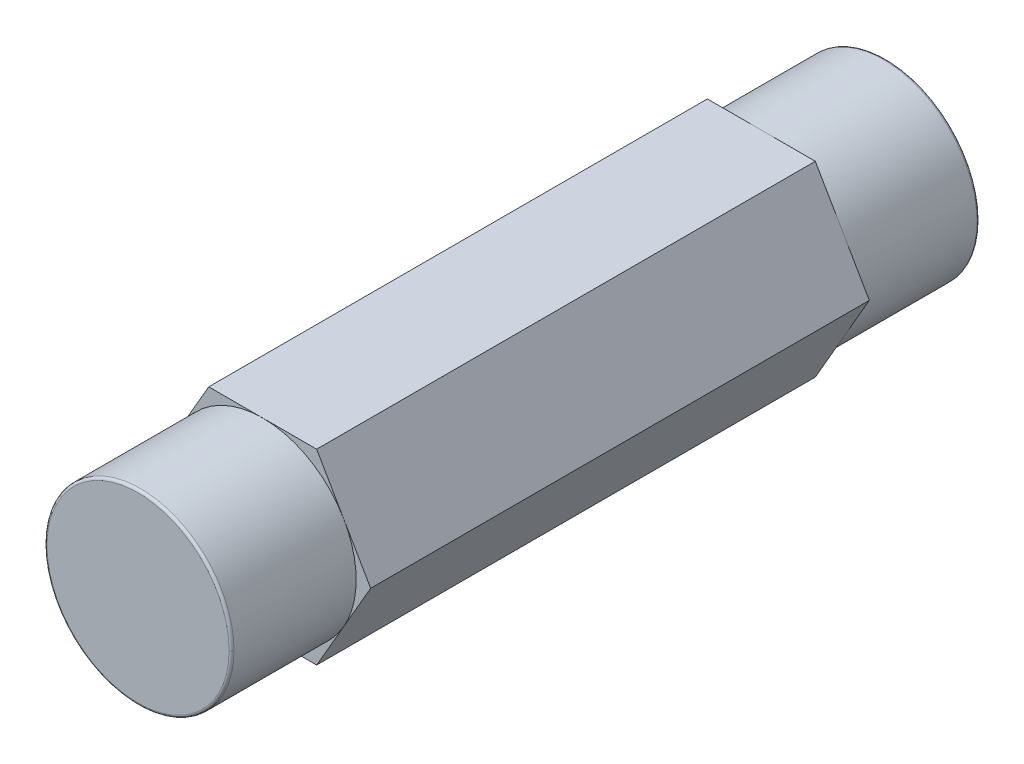
ISO-10303-21;
HEADER;
FILE_DESCRIPTION(('STEP AP214'),'2;1');
FILE_NAME('part.step','',(''),(''),'','','');
FILE_SCHEMA(('AUTOMOTIVE_DESIGN { 1 0 10303 214 1 1 1 1 }'));
ENDSEC;
DATA;
#1=APPLICATION_CONTEXT('core data for automotive mechanical design processes');
#2=APPLICATION_PROTOCOL_DEFINITION('international standard','automotive_design',2000,#1);
#3=PRODUCT_CONTEXT('',#1,'mechanical');
#4=PRODUCT('Part','Part','',(#3));
#5=PRODUCT_RELATED_PRODUCT_CATEGORY('part','',(#4));
#6=PRODUCT_DEFINITION_FORMATION('','',#4);
#7=PRODUCT_DEFINITION_CONTEXT('part definition',#1,'design');
#8=PRODUCT_DEFINITION('design','',#6,#7);
#9=PRODUCT_DEFINITION_SHAPE('','',#8);
#10=(LENGTH_UNIT() NAMED_UNIT(*) SI_UNIT(.MILLI.,.METRE.));
#11=(NAMED_UNIT(*) PLANE_ANGLE_UNIT() SI_UNIT($,.RADIAN.));
#12=(NAMED_UNIT(*) SI_UNIT($,.STERADIAN.) SOLID_ANGLE_UNIT());
#13=UNCERTAINTY_MEASURE_WITH_UNIT(LENGTH_MEASURE(1.E-05),#10,'distance_accuracy_value','');
#14=(GEOMETRIC_REPRESENTATION_CONTEXT(3) GLOBAL_UNCERTAINTY_ASSIGNED_CONTEXT((#13)) GLOBAL_UNIT_ASSIGNED_CONTEXT((#10,
#11,#12)) REPRESENTATION_CONTEXT('',''));
#15=CARTESIAN_POINT('',(0.,0.,0.));
#16=DIRECTION('',(0.,0.,1.));
#17=DIRECTION('',(1.,0.,0.));
#18=AXIS2_PLACEMENT_3D('',#15,#16,#17);
#19=CARTESIAN_POINT('',(0.,0.,0.));
#20=DIRECTION('',(0.,0.,1.));
#21=DIRECTION('',(1.,0.,0.));
#22=AXIS2_PLACEMENT_3D('',#19,#20,#21);
#23=PLANE('',#22);
#24=CARTESIAN_POINT('',(0.,0.,0.));
#25=DIRECTION('',(0.,0.,1.));
#26=DIRECTION('',(1.,0.,0.));
#27=AXIS2_PLACEMENT_3D('',#24,#25,#26);
#28=CIRCLE('',#27,4.6355);
#29=CARTESIAN_POINT('',(-4.6355,0.,0.));
#30=VERTEX_POINT('',#29);
#31=CARTESIAN_POINT('',(4.6355,0.,0.));
#32=VERTEX_POINT('',#31);
#33=EDGE_CURVE('E177',#30,#32,#28,.F.);
#34=ORIENTED_EDGE('',*,*,#33,.T.);
#35=CARTESIAN_POINT('',(0.,0.,0.));
#36=DIRECTION('',(0.,0.,1.));
#37=DIRECTION('',(-1.,0.,0.));
#38=AXIS2_PLACEMENT_3D('',#35,#36,#37);
#39=CIRCLE('',#38,4.6355);
#40=EDGE_CURVE('E233',#32,#30,#39,.F.);
#41=ORIENTED_EDGE('',*,*,#40,.T.);
#42=EDGE_LOOP('',(#34,#41));
#43=FACE_BOUND('',#42,.T.);
#44=ADVANCED_FACE('F17',(#43),#23,.F.);
#45=CARTESIAN_POINT('',(4.6355,0.,0.));
#46=CARTESIAN_POINT('',(4.70989487757862,0.,0.));
#47=CARTESIAN_POINT('',(4.7625,0.,0.0526051224213831));
#48=CARTESIAN_POINT('',(4.7625,0.,0.127));
#49=(BOUNDED_CURVE() B_SPLINE_CURVE(3,(#45,#46,#47,#48),.UNSPECIFIED.,.F.,
.F.) B_SPLINE_CURVE_WITH_KNOTS((4,4),(0.,1.),
.UNSPECIFIED.) CURVE() GEOMETRIC_REPRESENTATION_ITEM() RATIONAL_B_SPLINE_CURVE((1.,
0.804737854124365,0.804737854124365,1.)) REPRESENTATION_ITEM(''));
#50=CARTESIAN_POINT('',(0.,0.,0.127));
#51=DIRECTION('',(0.,0.,1.));
#52=AXIS1_PLACEMENT('',#50,#51);
#53=SURFACE_OF_REVOLUTION('',#49,#52);
#54=CARTESIAN_POINT('',(0.,0.,0.1270000007112));
#55=DIRECTION('',(0.,0.,-1.));
#56=DIRECTION('',(-1.,0.,0.));
#57=AXIS2_PLACEMENT_3D('',#54,#55,#56);
#58=CIRCLE('',#57,4.7625);
#59=CARTESIAN_POINT('',(-4.7625,0.,0.1270000007112));
#60=VERTEX_POINT('',#59);
#61=EDGE_CURVE('E155',#60,#60,#58,.T.);
#62=ORIENTED_EDGE('',*,*,#61,.T.);
#63=EDGE_LOOP('',(#62));
#64=FACE_BOUND('',#63,.T.);
#65=ORIENTED_EDGE('',*,*,#33,.F.);
#66=ORIENTED_EDGE('',*,*,#40,.F.);
#67=EDGE_LOOP('',(#65,#66));
#68=FACE_BOUND('',#67,.T.);
#69=ADVANCED_FACE('F187',(#64,#68),#53,.T.);
#70=CARTESIAN_POINT('',(0.,0.,6.35));
#71=DIRECTION('',(0.,0.,-1.));
#72=DIRECTION('',(-1.,0.,0.));
#73=AXIS2_PLACEMENT_3D('',#70,#71,#72);
#74=CYLINDRICAL_SURFACE('',#73,4.7625);
#75=ORIENTED_EDGE('',*,*,#61,.F.);
#76=EDGE_LOOP('',(#75));
#77=FACE_BOUND('',#76,.T.);
#78=CARTESIAN_POINT('',(0.,0.,6.35));
#79=DIRECTION('',(0.,0.,-1.));
#80=DIRECTION('',(-1.,0.,0.));
#81=AXIS2_PLACEMENT_3D('',#78,#79,#80);
#82=CIRCLE('',#81,4.7625);
#83=CARTESIAN_POINT('',(7.93759182454384E-11,4.76250000008065,6.35));
#84=VERTEX_POINT('',#83);
#85=CARTESIAN_POINT('',(4.12444598546886,2.38124999996313,6.35));
#86=VERTEX_POINT('',#85);
#87=EDGE_CURVE('E123',#84,#86,#82,.T.);
#88=ORIENTED_EDGE('',*,*,#87,.T.);
#89=CARTESIAN_POINT('',(0.,0.,6.35));
#90=DIRECTION('',(0.,0.,-1.));
#91=DIRECTION('',(-1.,0.,0.));
#92=AXIS2_PLACEMENT_3D('',#89,#90,#91);
#93=CIRCLE('',#92,4.7625);
#94=CARTESIAN_POINT('',(4.12444598526673,-2.38125000037889,6.35));
#95=VERTEX_POINT('',#94);
#96=EDGE_CURVE('E129',#86,#95,#93,.T.);
#97=ORIENTED_EDGE('',*,*,#96,.T.);
#98=CARTESIAN_POINT('',(0.,0.,6.35));
#99=DIRECTION('',(0.,0.,-1.));
#100=DIRECTION('',(-1.,0.,0.));
#101=AXIS2_PLACEMENT_3D('',#98,#99,#100);
#102=CIRCLE('',#101,4.7625);
#103=CARTESIAN_POINT('',(-6.10882556761237E-10,-4.76250000008065,6.35));
#104=VERTEX_POINT('',#103);
#105=EDGE_CURVE('E137',#95,#104,#102,.T.);
#106=ORIENTED_EDGE('',*,*,#105,.T.);
#107=CARTESIAN_POINT('',(0.,0.,6.35));
#108=DIRECTION('',(0.,0.,-1.));
#109=DIRECTION('',(-1.,0.,0.));
#110=AXIS2_PLACEMENT_3D('',#107,#108,#109);
#111=CIRCLE('',#110,4.7625);
#112=CARTESIAN_POINT('',(-4.12444598566227,-2.38124999969379,6.35));
#113=VERTEX_POINT('',#112);
#114=EDGE_CURVE('E228',#104,#113,#111,.T.);
#115=ORIENTED_EDGE('',*,*,#114,.T.);
#116=CARTESIAN_POINT('',(0.,0.,6.35));
#117=DIRECTION('',(0.,0.,-1.));
#118=DIRECTION('',(-1.,0.,0.));
#119=AXIS2_PLACEMENT_3D('',#116,#117,#118);
#120=CIRCLE('',#119,4.7625);
#121=CARTESIAN_POINT('',(-4.12444598549729,2.38124999997954,6.35));
#122=VERTEX_POINT('',#121);
#123=EDGE_CURVE('E172',#113,#122,#120,.T.);
#124=ORIENTED_EDGE('',*,*,#123,.T.);
#125=CARTESIAN_POINT('',(0.,0.,6.35));
#126=DIRECTION('',(0.,0.,-1.));
#127=DIRECTION('',(-1.,0.,0.));
#128=AXIS2_PLACEMENT_3D('',#125,#126,#127);
#129=CIRCLE('',#128,4.7625);
#130=EDGE_CURVE('E153',#122,#84,#129,.T.);
#131=ORIENTED_EDGE('',*,*,#130,.T.);
#132=EDGE_LOOP('',(#88,#97,#106,#115,#124,#131));
#133=FACE_BOUND('',#132,.T.);
#134=ADVANCED_FACE('F151',(#77,#133),#74,.T.);
#135=CARTESIAN_POINT('',(0.,0.,6.35));
#136=DIRECTION('',(0.,0.,-1.));
#137=DIRECTION('',(-1.,0.,0.));
#138=AXIS2_PLACEMENT_3D('',#135,#136,#137);
#139=PLANE('',#138);
#140=DIRECTION('',(0.499999999976173,-0.866025403798195,0.));
#141=VECTOR('',#140,1.);
#142=CARTESIAN_POINT('',(4.12444598553204,2.3812499998537,6.35));
#143=LINE('',#142,#141);
#144=CARTESIAN_POINT('',(2.74963065736356,4.76249999985952,6.35));
#145=VERTEX_POINT('',#144);
#146=EDGE_CURVE('E143',#145,#86,#143,.T.);
#147=ORIENTED_EDGE('',*,*,#146,.T.);
#148=ORIENTED_EDGE('',*,*,#87,.F.);
#149=DIRECTION('',(1.,0.,0.));
#150=VECTOR('',#149,1.);
#151=CARTESIAN_POINT('',(0.,4.76250000016129,6.35));
#152=LINE('',#151,#150);
#153=EDGE_CURVE('E158',#84,#145,#152,.T.);
#154=ORIENTED_EDGE('',*,*,#153,.T.);
#155=EDGE_LOOP('',(#147,#148,#154));
#156=FACE_BOUND('',#155,.T.);
#157=ADVANCED_FACE('F157',(#156),#139,.T.);
#158=CARTESIAN_POINT('',(0.,0.,6.35));
#159=DIRECTION('',(0.,0.,-1.));
#160=DIRECTION('',(-1.,0.,0.));
#161=AXIS2_PLACEMENT_3D('',#158,#159,#160);
#162=PLANE('',#161);
#163=DIRECTION('',(1.,0.,0.));
#164=VECTOR('',#163,1.);
#165=CARTESIAN_POINT('',(0.,-4.76250000016129,6.35));
#166=LINE('',#165,#164);
#167=CARTESIAN_POINT('',(2.74963065719535,-4.76249999985952,6.35));
#168=VERTEX_POINT('',#167);
#169=EDGE_CURVE('E136',#168,#104,#166,.F.);
#170=ORIENTED_EDGE('',*,*,#169,.T.);
#171=ORIENTED_EDGE('',*,*,#105,.F.);
#172=DIRECTION('',(-0.499999999976173,-0.866025403798195,0.));
#173=VECTOR('',#172,1.);
#174=CARTESIAN_POINT('',(4.12444598553204,-2.3812499998537,6.35));
#175=LINE('',#174,#173);
#176=EDGE_CURVE('E159',#95,#168,#175,.T.);
#177=ORIENTED_EDGE('',*,*,#176,.T.);
#178=EDGE_LOOP('',(#170,#171,#177));
#179=FACE_BOUND('',#178,.T.);
#180=ADVANCED_FACE('F451',(#179),#162,.T.);
#181=CARTESIAN_POINT('',(0.,0.,6.35));
#182=DIRECTION('',(0.,0.,-1.));
#183=DIRECTION('',(-1.,0.,0.));
#184=AXIS2_PLACEMENT_3D('',#181,#182,#183);
#185=PLANE('',#184);
#186=DIRECTION('',(-0.499999999976173,-0.866025403798195,0.));
#187=VECTOR('',#186,1.);
#188=CARTESIAN_POINT('',(4.12444598553204,-2.3812499998537,6.35));
#189=LINE('',#188,#187);
#190=CARTESIAN_POINT('',(5.49926131361601,-1.45494438256547E-10,6.35));
#191=VERTEX_POINT('',#190);
#192=EDGE_CURVE('E134',#191,#95,#189,.T.);
#193=ORIENTED_EDGE('',*,*,#192,.T.);
#194=ORIENTED_EDGE('',*,*,#96,.F.);
#195=DIRECTION('',(0.499999999976173,-0.866025403798195,0.));
#196=VECTOR('',#195,1.);
#197=CARTESIAN_POINT('',(4.12444598553204,2.3812499998537,6.35));
#198=LINE('',#197,#196);
#199=EDGE_CURVE('E132',#86,#191,#198,.T.);
#200=ORIENTED_EDGE('',*,*,#199,.T.);
#201=EDGE_LOOP('',(#193,#194,#200));
#202=FACE_BOUND('',#201,.T.);
#203=ADVANCED_FACE('F131',(#202),#185,.T.);
#204=CARTESIAN_POINT('',(0.,-4.76250000016129,0.));
#205=DIRECTION('',(0.,1.,0.));
#206=DIRECTION('',(0.,0.,1.));
#207=AXIS2_PLACEMENT_3D('',#204,#205,#206);
#208=PLANE('',#207);
#209=DIRECTION('',(0.,0.,1.));
#210=VECTOR('',#209,1.);
#211=CARTESIAN_POINT('',(2.74963065719535,-4.76249999970864,0.));
#212=LINE('',#211,#210);
#213=CARTESIAN_POINT('',(2.74963065753178,-4.76249999990288,31.7499999967742));
#214=VERTEX_POINT('',#213);
#215=EDGE_CURVE('E162',#168,#214,#212,.T.);
#216=ORIENTED_EDGE('',*,*,#215,.T.);
#217=DIRECTION('',(1.,0.,0.));
#218=VECTOR('',#217,1.);
#219=CARTESIAN_POINT('',(0.,-4.7625,31.7499999967742));
#220=LINE('',#219,#218);
#221=CARTESIAN_POINT('',(-4.61120253145E-10,-4.7625,31.7499999983871));
#222=VERTEX_POINT('',#221);
#223=EDGE_CURVE('E395',#214,#222,#220,.F.);
#224=ORIENTED_EDGE('',*,*,#223,.T.);
#225=DIRECTION('',(1.,0.,0.));
#226=VECTOR('',#225,1.);
#227=CARTESIAN_POINT('',(0.,-4.7625,31.7499999967742));
#228=LINE('',#227,#226);
#229=CARTESIAN_POINT('',(-2.74963065736356,-4.76249999980576,31.7499999989247));
#230=VERTEX_POINT('',#229);
#231=EDGE_CURVE('E388',#222,#230,#228,.F.);
#232=ORIENTED_EDGE('',*,*,#231,.T.);
#233=DIRECTION('',(0.,0.,1.));
#234=VECTOR('',#233,1.);
#235=CARTESIAN_POINT('',(-2.74963065719535,-4.76249999970864,0.));
#236=LINE('',#235,#234);
#237=CARTESIAN_POINT('',(-2.74963065736356,-4.76249999980576,6.35));
#238=VERTEX_POINT('',#237);
#239=EDGE_CURVE('E384',#230,#238,#236,.F.);
#240=ORIENTED_EDGE('',*,*,#239,.T.);
#241=DIRECTION('',(-1.,0.,0.));
#242=VECTOR('',#241,1.);
#243=CARTESIAN_POINT('',(0.,-4.7625,6.35));
#244=LINE('',#243,#242);
#245=EDGE_CURVE('E230',#238,#104,#244,.F.);
#246=ORIENTED_EDGE('',*,*,#245,.T.);
#247=ORIENTED_EDGE('',*,*,#169,.F.);
#248=EDGE_LOOP('',(#216,#224,#232,#240,#246,#247));
#249=FACE_BOUND('',#248,.T.);
#250=ADVANCED_FACE('F458',(#249),#208,.F.);
#251=CARTESIAN_POINT('',(0.,0.,6.35));
#252=DIRECTION('',(0.,0.,-1.));
#253=DIRECTION('',(-1.,0.,0.));
#254=AXIS2_PLACEMENT_3D('',#251,#252,#253);
#255=PLANE('',#254);
#256=ORIENTED_EDGE('',*,*,#114,.F.);
#257=ORIENTED_EDGE('',*,*,#245,.F.);
#258=DIRECTION('',(-0.499999999976173,0.866025403798195,0.));
#259=VECTOR('',#258,1.);
#260=CARTESIAN_POINT('',(-4.12444598553204,-2.3812499998537,6.35));
#261=LINE('',#260,#259);
#262=EDGE_CURVE('E413',#238,#113,#261,.T.);
#263=ORIENTED_EDGE('',*,*,#262,.T.);
#264=EDGE_LOOP('',(#256,#257,#263));
#265=FACE_BOUND('',#264,.T.);
#266=ADVANCED_FACE('F456',(#265),#255,.T.);
#267=CARTESIAN_POINT('',(0.,0.,6.35));
#268=DIRECTION('',(0.,0.,-1.));
#269=DIRECTION('',(-1.,0.,0.));
#270=AXIS2_PLACEMENT_3D('',#267,#268,#269);
#271=PLANE('',#270);
#272=ORIENTED_EDGE('',*,*,#130,.F.);
#273=DIRECTION('',(0.499999999976173,0.866025403798195,0.));
#274=VECTOR('',#273,1.);
#275=CARTESIAN_POINT('',(-4.12444598553204,2.3812499998537,6.35));
#276=LINE('',#275,#274);
#277=CARTESIAN_POINT('',(-2.74963065719535,4.76249999985952,6.35));
#278=VERTEX_POINT('',#277);
#279=EDGE_CURVE('E408',#122,#278,#276,.T.);
#280=ORIENTED_EDGE('',*,*,#279,.T.);
#281=DIRECTION('',(1.,0.,0.));
#282=VECTOR('',#281,1.);
#283=CARTESIAN_POINT('',(0.,4.76250000016129,6.35));
#284=LINE('',#283,#282);
#285=EDGE_CURVE('E148',#278,#84,#284,.T.);
#286=ORIENTED_EDGE('',*,*,#285,.T.);
#287=EDGE_LOOP('',(#272,#280,#286));
#288=FACE_BOUND('',#287,.T.);
#289=ADVANCED_FACE('F480',(#288),#271,.T.);
#290=CARTESIAN_POINT('',(0.,0.,6.35));
#291=DIRECTION('',(0.,0.,-1.));
#292=DIRECTION('',(-1.,0.,0.));
#293=AXIS2_PLACEMENT_3D('',#290,#291,#292);
#294=PLANE('',#293);
#295=ORIENTED_EDGE('',*,*,#123,.F.);
#296=DIRECTION('',(-0.499999999976173,0.866025403798195,0.));
#297=VECTOR('',#296,1.);
#298=CARTESIAN_POINT('',(-4.12444598553204,-2.3812499998537,6.35));
#299=LINE('',#298,#297);
#300=CARTESIAN_POINT('',(-5.49926131361601,1.45494438256547E-10,6.35));
#301=VERTEX_POINT('',#300);
#302=EDGE_CURVE('E385',#113,#301,#299,.T.);
#303=ORIENTED_EDGE('',*,*,#302,.T.);
#304=DIRECTION('',(0.499999999976173,0.866025403798195,0.));
#305=VECTOR('',#304,1.);
#306=CARTESIAN_POINT('',(-4.12444598553204,2.3812499998537,6.35));
#307=LINE('',#306,#305);
#308=EDGE_CURVE('E372',#301,#122,#307,.T.);
#309=ORIENTED_EDGE('',*,*,#308,.T.);
#310=EDGE_LOOP('',(#295,#303,#309));
#311=FACE_BOUND('',#310,.T.);
#312=ADVANCED_FACE('F477',(#311),#294,.T.);
#313=CARTESIAN_POINT('',(0.,4.76250000016129,0.));
#314=DIRECTION('',(0.,-1.,0.));
#315=DIRECTION('',(0.,0.,-1.));
#316=AXIS2_PLACEMENT_3D('',#313,#314,#315);
#317=PLANE('',#316);
#318=DIRECTION('',(0.,0.,1.));
#319=VECTOR('',#318,1.);
#320=CARTESIAN_POINT('',(-2.74963065719535,4.76249999970864,0.));
#321=LINE('',#320,#319);
#322=CARTESIAN_POINT('',(-2.74963065753178,4.76249999990288,31.7499999978495));
#323=VERTEX_POINT('',#322);
#324=EDGE_CURVE('E378',#278,#323,#321,.T.);
#325=ORIENTED_EDGE('',*,*,#324,.T.);
#326=DIRECTION('',(1.,0.,0.));
#327=VECTOR('',#326,1.);
#328=CARTESIAN_POINT('',(0.,4.7625,31.7499999967742));
#329=LINE('',#328,#327);
#330=CARTESIAN_POINT('',(-7.93759182454384E-11,4.7625,31.7499999983871));
#331=VERTEX_POINT('',#330);
#332=EDGE_CURVE('E329',#323,#331,#329,.T.);
#333=ORIENTED_EDGE('',*,*,#332,.T.);
#334=DIRECTION('',(1.,0.,0.));
#335=VECTOR('',#334,1.);
#336=CARTESIAN_POINT('',(0.,4.7625,31.7499999967742));
#337=LINE('',#336,#335);
#338=CARTESIAN_POINT('',(2.74963065753178,4.76249999990288,31.7499999967742));
#339=VERTEX_POINT('',#338);
#340=EDGE_CURVE('E324',#331,#339,#337,.T.);
#341=ORIENTED_EDGE('',*,*,#340,.T.);
#342=DIRECTION('',(0.,0.,1.));
#343=VECTOR('',#342,1.);
#344=CARTESIAN_POINT('',(2.74963065719535,4.76249999970864,0.));
#345=LINE('',#344,#343);
#346=EDGE_CURVE('E147',#339,#145,#345,.F.);
#347=ORIENTED_EDGE('',*,*,#346,.T.);
#348=ORIENTED_EDGE('',*,*,#153,.F.);
#349=ORIENTED_EDGE('',*,*,#285,.F.);
#350=EDGE_LOOP('',(#325,#333,#341,#347,#348,#349));
#351=FACE_BOUND('',#350,.T.);
#352=ADVANCED_FACE('F479',(#351),#317,.F.);
#353=CARTESIAN_POINT('',(4.12444598553204,2.3812499998537,0.));
#354=DIRECTION('',(-0.866025403798195,-0.499999999976173,0.));
#355=DIRECTION('',(0.499999999976173,-0.866025403798195,0.));
#356=AXIS2_PLACEMENT_3D('',#353,#354,#355);
#357=PLANE('',#356);
#358=ORIENTED_EDGE('',*,*,#346,.F.);
#359=DIRECTION('',(0.49999999974693,-0.866025403930548,0.));
#360=VECTOR('',#359,1.);
#361=CARTESIAN_POINT('',(2.7496306577,4.7625,31.7499999967742));
#362=LINE('',#361,#360);
#363=CARTESIAN_POINT('',(4.12444598565835,2.38124999934468,31.7499999983871));
#364=VERTEX_POINT('',#363);
#365=EDGE_CURVE('E319',#339,#364,#362,.T.);
#366=ORIENTED_EDGE('',*,*,#365,.T.);
#367=DIRECTION('',(0.499999999746931,-0.866025403930548,0.));
#368=VECTOR('',#367,1.);
#369=CARTESIAN_POINT('',(4.12444598528,2.38125,31.7499999967742));
#370=LINE('',#369,#368);
#371=CARTESIAN_POINT('',(5.499261313112,-1.45495072005185E-10,31.7499999967742));
#372=VERTEX_POINT('',#371);
#373=EDGE_CURVE('E315',#364,#372,#370,.T.);
#374=ORIENTED_EDGE('',*,*,#373,.T.);
#375=DIRECTION('',(0.,0.,1.));
#376=VECTOR('',#375,1.);
#377=CARTESIAN_POINT('',(5.49926131361601,-4.36483314769642E-10,0.));
#378=LINE('',#377,#376);
#379=EDGE_CURVE('E146',#372,#191,#378,.F.);
#380=ORIENTED_EDGE('',*,*,#379,.T.);
#381=ORIENTED_EDGE('',*,*,#199,.F.);
#382=ORIENTED_EDGE('',*,*,#146,.F.);
#383=EDGE_LOOP('',(#358,#366,#374,#380,#381,#382));
#384=FACE_BOUND('',#383,.T.);
#385=ADVANCED_FACE('F142',(#384),#357,.F.);
#386=CARTESIAN_POINT('',(4.12444598553204,-2.3812499998537,0.));
#387=DIRECTION('',(-0.866025403798195,0.499999999976173,0.));
#388=DIRECTION('',(-0.499999999976173,-0.866025403798195,0.));
#389=AXIS2_PLACEMENT_3D('',#386,#387,#388);
#390=PLANE('',#389);
#391=ORIENTED_EDGE('',*,*,#379,.F.);
#392=DIRECTION('',(-0.499999999626931,-0.86602540399983,0.));
#393=VECTOR('',#392,1.);
#394=CARTESIAN_POINT('',(5.49926131286,0.,31.7499999967742));
#395=LINE('',#394,#393);
#396=CARTESIAN_POINT('',(4.1244459859883,-2.38124999953518,31.7499999983871));
#397=VERTEX_POINT('',#396);
#398=EDGE_CURVE('E308',#372,#397,#395,.T.);
#399=ORIENTED_EDGE('',*,*,#398,.T.);
#400=DIRECTION('',(-0.49999999986693,-0.866025403861266,0.));
#401=VECTOR('',#400,1.);
#402=CARTESIAN_POINT('',(4.12444598528,-2.381250000762,31.7499999967742));
#403=LINE('',#402,#401);
#404=EDGE_CURVE('E390',#397,#214,#403,.T.);
#405=ORIENTED_EDGE('',*,*,#404,.T.);
#406=ORIENTED_EDGE('',*,*,#215,.F.);
#407=ORIENTED_EDGE('',*,*,#176,.F.);
#408=ORIENTED_EDGE('',*,*,#192,.F.);
#409=EDGE_LOOP('',(#391,#399,#405,#406,#407,#408));
#410=FACE_BOUND('',#409,.T.);
#411=ADVANCED_FACE('F572',(#410),#390,.F.);
#412=CARTESIAN_POINT('',(0.,0.,31.7499999967742));
#413=DIRECTION('',(0.,0.,1.));
#414=DIRECTION('',(1.,0.,0.));
#415=AXIS2_PLACEMENT_3D('',#412,#413,#414);
#416=PLANE('',#415);
#417=CARTESIAN_POINT('',(0.,0.,31.75));
#418=DIRECTION('',(0.,0.,1.));
#419=DIRECTION('',(1.,0.,0.));
#420=AXIS2_PLACEMENT_3D('',#417,#418,#419);
#421=CIRCLE('',#420,4.7625);
#422=EDGE_CURVE('E222',#397,#222,#421,.F.);
#423=ORIENTED_EDGE('',*,*,#422,.T.);
#424=ORIENTED_EDGE('',*,*,#223,.F.);
#425=ORIENTED_EDGE('',*,*,#404,.F.);
#426=EDGE_LOOP('',(#423,#424,#425));
#427=FACE_BOUND('',#426,.T.);
#428=ADVANCED_FACE('F579',(#427),#416,.T.);
#429=CARTESIAN_POINT('',(0.,0.,31.7499999967742));
#430=DIRECTION('',(0.,0.,1.));
#431=DIRECTION('',(1.,0.,0.));
#432=AXIS2_PLACEMENT_3D('',#429,#430,#431);
#433=PLANE('',#432);
#434=ORIENTED_EDGE('',*,*,#231,.F.);
#435=CARTESIAN_POINT('',(0.,0.,31.75));
#436=DIRECTION('',(0.,0.,1.));
#437=DIRECTION('',(1.,0.,0.));
#438=AXIS2_PLACEMENT_3D('',#435,#436,#437);
#439=CIRCLE('',#438,4.7625);
#440=CARTESIAN_POINT('',(-4.12444598545441,-2.38124999946203,31.75));
#441=VERTEX_POINT('',#440);
#442=EDGE_CURVE('E218',#222,#441,#439,.F.);
#443=ORIENTED_EDGE('',*,*,#442,.T.);
#444=DIRECTION('',(-0.499999999976173,0.866025403798195,0.));
#445=VECTOR('',#444,1.);
#446=CARTESIAN_POINT('',(-4.12444598553204,-2.3812499998537,31.75));
#447=LINE('',#446,#445);
#448=EDGE_CURVE('E381',#441,#230,#447,.F.);
#449=ORIENTED_EDGE('',*,*,#448,.T.);
#450=EDGE_LOOP('',(#434,#443,#449));
#451=FACE_BOUND('',#450,.T.);
#452=ADVANCED_FACE('F465',(#451),#433,.T.);
#453=CARTESIAN_POINT('',(-4.12444598553204,-2.3812499998537,0.));
#454=DIRECTION('',(0.866025403798195,0.499999999976173,0.));
#455=DIRECTION('',(-0.499999999976173,0.866025403798195,0.));
#456=AXIS2_PLACEMENT_3D('',#453,#454,#455);
#457=PLANE('',#456);
#458=ORIENTED_EDGE('',*,*,#239,.F.);
#459=ORIENTED_EDGE('',*,*,#448,.F.);
#460=DIRECTION('',(-0.499999999866931,0.866025403861266,0.));
#461=VECTOR('',#460,1.);
#462=CARTESIAN_POINT('',(-4.12444598528,-2.381249999238,31.7499999967742));
#463=LINE('',#462,#461);
#464=CARTESIAN_POINT('',(-5.499261313112,1.45494057488417E-10,31.7499999967742));
#465=VERTEX_POINT('',#464);
#466=EDGE_CURVE('E221',#441,#465,#463,.T.);
#467=ORIENTED_EDGE('',*,*,#466,.T.);
#468=DIRECTION('',(0.,0.,1.));
#469=VECTOR('',#468,1.);
#470=CARTESIAN_POINT('',(-5.49926131361601,4.36483314769642E-10,0.));
#471=LINE('',#470,#469);
#472=EDGE_CURVE('E375',#465,#301,#471,.F.);
#473=ORIENTED_EDGE('',*,*,#472,.T.);
#474=ORIENTED_EDGE('',*,*,#302,.F.);
#475=ORIENTED_EDGE('',*,*,#262,.F.);
#476=EDGE_LOOP('',(#458,#459,#467,#473,#474,#475));
#477=FACE_BOUND('',#476,.T.);
#478=ADVANCED_FACE('F462',(#477),#457,.F.);
#479=CARTESIAN_POINT('',(-4.12444598553204,2.3812499998537,0.));
#480=DIRECTION('',(0.866025403798195,-0.499999999976173,0.));
#481=DIRECTION('',(0.499999999976173,0.866025403798195,0.));
#482=AXIS2_PLACEMENT_3D('',#479,#480,#481);
#483=PLANE('',#482);
#484=ORIENTED_EDGE('',*,*,#472,.F.);
#485=DIRECTION('',(0.499999999746931,0.866025403930548,0.));
#486=VECTOR('',#485,1.);
#487=CARTESIAN_POINT('',(-5.49926131286,0.,31.7499999967742));
#488=LINE('',#487,#486);
#489=CARTESIAN_POINT('',(-4.12444598565835,2.38124999934468,31.7499999983871));
#490=VERTEX_POINT('',#489);
#491=EDGE_CURVE('E293',#465,#490,#488,.T.);
#492=ORIENTED_EDGE('',*,*,#491,.T.);
#493=DIRECTION('',(0.49999999974693,0.866025403930548,0.));
#494=VECTOR('',#493,1.);
#495=CARTESIAN_POINT('',(-4.12444598528,2.38125,31.7499999967742));
#496=LINE('',#495,#494);
#497=EDGE_CURVE('E334',#490,#323,#496,.T.);
#498=ORIENTED_EDGE('',*,*,#497,.T.);
#499=ORIENTED_EDGE('',*,*,#324,.F.);
#500=ORIENTED_EDGE('',*,*,#279,.F.);
#501=ORIENTED_EDGE('',*,*,#308,.F.);
#502=EDGE_LOOP('',(#484,#492,#498,#499,#500,#501));
#503=FACE_BOUND('',#502,.T.);
#504=ADVANCED_FACE('F356',(#503),#483,.F.);
#505=CARTESIAN_POINT('',(-4.7625,0.,37.973));
#506=CARTESIAN_POINT('',(-4.7625,0.,38.1059272719151));
#507=CARTESIAN_POINT('',(-4.63969121416509,0.,38.1567963365865));
#508=CARTESIAN_POINT('',(-4.54569743878931,0.,38.0628025612107));
#509=CARTESIAN_POINT('',(-4.45170366341353,0.,37.9688087858349));
#510=CARTESIAN_POINT('',(-4.50257272808492,0.,37.846));
#511=CARTESIAN_POINT('',(-4.6355,0.,37.846));
#512=(BOUNDED_CURVE() B_SPLINE_CURVE(3,(#505,#506,#507,#508,#509,#510,#511),.UNSPECIFIED.,.F.,
.F.) B_SPLINE_CURVE_WITH_KNOTS((4,3,4),(0.,0.5,1.),
.UNSPECIFIED.) CURVE() GEOMETRIC_REPRESENTATION_ITEM() RATIONAL_B_SPLINE_CURVE((1.,
0.588455621576726,0.588455621576726,1.,0.588455621576726,0.588455621576726,1.)) REPRESENTATION_ITEM(''));
#513=CARTESIAN_POINT('',(0.,0.,37.973));
#514=DIRECTION('',(0.,0.,1.));
#515=AXIS1_PLACEMENT('',#513,#514);
#516=SURFACE_OF_REVOLUTION('',#512,#515);
#517=CARTESIAN_POINT('',(0.,0.,37.973));
#518=DIRECTION('',(0.,0.,1.));
#519=DIRECTION('',(-1.,0.,0.));
#520=AXIS2_PLACEMENT_3D('',#517,#518,#519);
#521=CIRCLE('',#520,4.7625);
#522=CARTESIAN_POINT('',(-4.7625,0.,37.973));
#523=VERTEX_POINT('',#522);
#524=CARTESIAN_POINT('',(4.7625,0.,37.973));
#525=VERTEX_POINT('',#524);
#526=EDGE_CURVE('E225',#523,#525,#521,.T.);
#527=ORIENTED_EDGE('',*,*,#526,.T.);
#528=CARTESIAN_POINT('',(4.6355,0.,37.973));
#529=DIRECTION('',(0.,1.,0.));
#530=DIRECTION('',(-1.,0.,0.));
#531=AXIS2_PLACEMENT_3D('',#528,#529,#530);
#532=CIRCLE('',#531,0.127);
#533=CARTESIAN_POINT('',(4.6355,0.,38.1));
#534=VERTEX_POINT('',#533);
#535=EDGE_CURVE('E368',#534,#525,#532,.T.);
#536=ORIENTED_EDGE('',*,*,#535,.F.);
#537=CARTESIAN_POINT('',(0.,0.,38.1));
#538=DIRECTION('',(0.,0.,-1.));
#539=DIRECTION('',(1.,0.,0.));
#540=AXIS2_PLACEMENT_3D('',#537,#538,#539);
#541=CIRCLE('',#540,4.6355);
#542=CARTESIAN_POINT('',(-4.6355,0.,38.1));
#543=VERTEX_POINT('',#542);
#544=EDGE_CURVE('E217',#534,#543,#541,.T.);
#545=ORIENTED_EDGE('',*,*,#544,.T.);
#546=CARTESIAN_POINT('',(-4.6355,0.,37.973));
#547=DIRECTION('',(0.,1.,0.));
#548=DIRECTION('',(0.,0.,1.));
#549=AXIS2_PLACEMENT_3D('',#546,#547,#548);
#550=CIRCLE('',#549,0.127);
#551=EDGE_CURVE('E37',#523,#543,#550,.T.);
#552=ORIENTED_EDGE('',*,*,#551,.F.);
#553=EDGE_LOOP('',(#527,#536,#545,#552));
#554=FACE_BOUND('',#553,.T.);
#555=ADVANCED_FACE('F350',(#554),#516,.T.);
#556=CARTESIAN_POINT('',(0.,0.,31.7499999967742));
#557=DIRECTION('',(0.,0.,1.));
#558=DIRECTION('',(1.,0.,0.));
#559=AXIS2_PLACEMENT_3D('',#556,#557,#558);
#560=PLANE('',#559);
#561=ORIENTED_EDGE('',*,*,#497,.F.);
#562=CARTESIAN_POINT('',(0.,0.,31.75));
#563=DIRECTION('',(0.,0.,1.));
#564=DIRECTION('',(1.,0.,0.));
#565=AXIS2_PLACEMENT_3D('',#562,#563,#564);
#566=CIRCLE('',#565,4.7625);
#567=EDGE_CURVE('E214',#490,#331,#566,.F.);
#568=ORIENTED_EDGE('',*,*,#567,.T.);
#569=ORIENTED_EDGE('',*,*,#332,.F.);
#570=EDGE_LOOP('',(#561,#568,#569));
#571=FACE_BOUND('',#570,.T.);
#572=ADVANCED_FACE('F355',(#571),#560,.T.);
#573=CARTESIAN_POINT('',(0.,0.,31.7499999967742));
#574=DIRECTION('',(0.,0.,1.));
#575=DIRECTION('',(1.,0.,0.));
#576=AXIS2_PLACEMENT_3D('',#573,#574,#575);
#577=PLANE('',#576);
#578=ORIENTED_EDGE('',*,*,#340,.F.);
#579=CARTESIAN_POINT('',(0.,0.,31.75));
#580=DIRECTION('',(0.,0.,1.));
#581=DIRECTION('',(1.,0.,0.));
#582=AXIS2_PLACEMENT_3D('',#579,#580,#581);
#583=CIRCLE('',#582,4.7625);
#584=EDGE_CURVE('E211',#331,#364,#583,.F.);
#585=ORIENTED_EDGE('',*,*,#584,.T.);
#586=ORIENTED_EDGE('',*,*,#365,.F.);
#587=EDGE_LOOP('',(#578,#585,#586));
#588=FACE_BOUND('',#587,.T.);
#589=ADVANCED_FACE('F620',(#588),#577,.T.);
#590=CARTESIAN_POINT('',(0.,0.,31.7499999967742));
#591=DIRECTION('',(0.,0.,1.));
#592=DIRECTION('',(1.,0.,0.));
#593=AXIS2_PLACEMENT_3D('',#590,#591,#592);
#594=PLANE('',#593);
#595=ORIENTED_EDGE('',*,*,#373,.F.);
#596=CARTESIAN_POINT('',(0.,0.,31.75));
#597=DIRECTION('',(0.,0.,1.));
#598=DIRECTION('',(1.,0.,0.));
#599=AXIS2_PLACEMENT_3D('',#596,#597,#598);
#600=CIRCLE('',#599,4.7625);
#601=EDGE_CURVE('E209',#364,#397,#600,.F.);
#602=ORIENTED_EDGE('',*,*,#601,.T.);
#603=ORIENTED_EDGE('',*,*,#398,.F.);
#604=EDGE_LOOP('',(#595,#602,#603));
#605=FACE_BOUND('',#604,.T.);
#606=ADVANCED_FACE('F628',(#605),#594,.T.);
#607=CARTESIAN_POINT('',(0.,0.,31.7499999967742));
#608=DIRECTION('',(0.,0.,1.));
#609=DIRECTION('',(1.,0.,0.));
#610=AXIS2_PLACEMENT_3D('',#607,#608,#609);
#611=PLANE('',#610);
#612=ORIENTED_EDGE('',*,*,#466,.F.);
#613=CARTESIAN_POINT('',(0.,0.,31.75));
#614=DIRECTION('',(0.,0.,1.));
#615=DIRECTION('',(1.,0.,0.));
#616=AXIS2_PLACEMENT_3D('',#613,#614,#615);
#617=CIRCLE('',#616,4.7625);
#618=EDGE_CURVE('E201',#441,#490,#617,.F.);
#619=ORIENTED_EDGE('',*,*,#618,.T.);
#620=ORIENTED_EDGE('',*,*,#491,.F.);
#621=EDGE_LOOP('',(#612,#619,#620));
#622=FACE_BOUND('',#621,.T.);
#623=ADVANCED_FACE('F279',(#622),#611,.T.);
#624=CARTESIAN_POINT('',(0.,0.,38.1));
#625=DIRECTION('',(0.,0.,1.));
#626=DIRECTION('',(1.,0.,0.));
#627=AXIS2_PLACEMENT_3D('',#624,#625,#626);
#628=PLANE('',#627);
#629=ORIENTED_EDGE('',*,*,#544,.F.);
#630=CARTESIAN_POINT('',(0.,0.,38.1));
#631=DIRECTION('',(0.,0.,-1.));
#632=DIRECTION('',(-1.,0.,0.));
#633=AXIS2_PLACEMENT_3D('',#630,#631,#632);
#634=CIRCLE('',#633,4.6355);
#635=EDGE_CURVE('E28',#534,#543,#634,.F.);
#636=ORIENTED_EDGE('',*,*,#635,.T.);
#637=EDGE_LOOP('',(#629,#636));
#638=FACE_BOUND('',#637,.T.);
#639=ADVANCED_FACE('F248',(#638),#628,.T.);
#640=CARTESIAN_POINT('',(0.,0.,31.75));
#641=DIRECTION('',(0.,0.,1.));
#642=DIRECTION('',(1.,0.,0.));
#643=AXIS2_PLACEMENT_3D('',#640,#641,#642);
#644=CYLINDRICAL_SURFACE('',#643,4.7625);
#645=CARTESIAN_POINT('',(0.,0.,37.973));
#646=DIRECTION('',(0.,0.,1.));
#647=DIRECTION('',(1.,0.,0.));
#648=AXIS2_PLACEMENT_3D('',#645,#646,#647);
#649=CIRCLE('',#648,4.7625);
#650=EDGE_CURVE('E11',#523,#525,#649,.F.);
#651=ORIENTED_EDGE('',*,*,#650,.T.);
#652=ORIENTED_EDGE('',*,*,#526,.F.);
#653=EDGE_LOOP('',(#651,#652));
#654=FACE_BOUND('',#653,.T.);
#655=ORIENTED_EDGE('',*,*,#618,.F.);
#656=ORIENTED_EDGE('',*,*,#442,.F.);
#657=ORIENTED_EDGE('',*,*,#422,.F.);
#658=ORIENTED_EDGE('',*,*,#601,.F.);
#659=ORIENTED_EDGE('',*,*,#584,.F.);
#660=ORIENTED_EDGE('',*,*,#567,.F.);
#661=EDGE_LOOP('',(#655,#656,#657,#658,#659,#660));
#662=FACE_BOUND('',#661,.T.);
#663=ADVANCED_FACE('F242',(#654,#662),#644,.T.);
#664=CARTESIAN_POINT('',(4.7625,0.,37.973));
#665=CARTESIAN_POINT('',(4.7625,0.,38.0473948775786));
#666=CARTESIAN_POINT('',(4.70989487757862,0.,38.1));
#667=CARTESIAN_POINT('',(4.6355,0.,38.1));
#668=(BOUNDED_CURVE() B_SPLINE_CURVE(3,(#664,#665,#666,#667),.UNSPECIFIED.,.F.,
.F.) B_SPLINE_CURVE_WITH_KNOTS((4,4),(0.,1.),
.UNSPECIFIED.) CURVE() GEOMETRIC_REPRESENTATION_ITEM() RATIONAL_B_SPLINE_CURVE((1.,
0.804737854124365,0.804737854124365,1.)) REPRESENTATION_ITEM(''));
#669=CARTESIAN_POINT('',(0.,0.,37.973));
#670=DIRECTION('',(0.,0.,1.));
#671=AXIS1_PLACEMENT('',#669,#670);
#672=SURFACE_OF_REVOLUTION('',#668,#671);
#673=ORIENTED_EDGE('',*,*,#551,.T.);
#674=ORIENTED_EDGE('',*,*,#635,.F.);
#675=ORIENTED_EDGE('',*,*,#535,.T.);
#676=ORIENTED_EDGE('',*,*,#650,.F.);
#677=EDGE_LOOP('',(#673,#674,#675,#676));
#678=FACE_BOUND('',#677,.T.);
#679=ADVANCED_FACE('F240',(#678),#672,.T.);
#680=CLOSED_SHELL('',(#44,#69,#134,#157,#180,#203,#250,#266,#289,#312,#352,#385,#411,#428,#452,
#478,#504,#555,#572,#589,#606,#623,#639,#663,#679));
#681=MANIFOLD_SOLID_BREP('B1',#680);
#682=ADVANCED_BREP_SHAPE_REPRESENTATION('',(#18,#681),#14);
#683=SHAPE_DEFINITION_REPRESENTATION(#9,#682);
ENDSEC;
END-ISO-10303-21;
